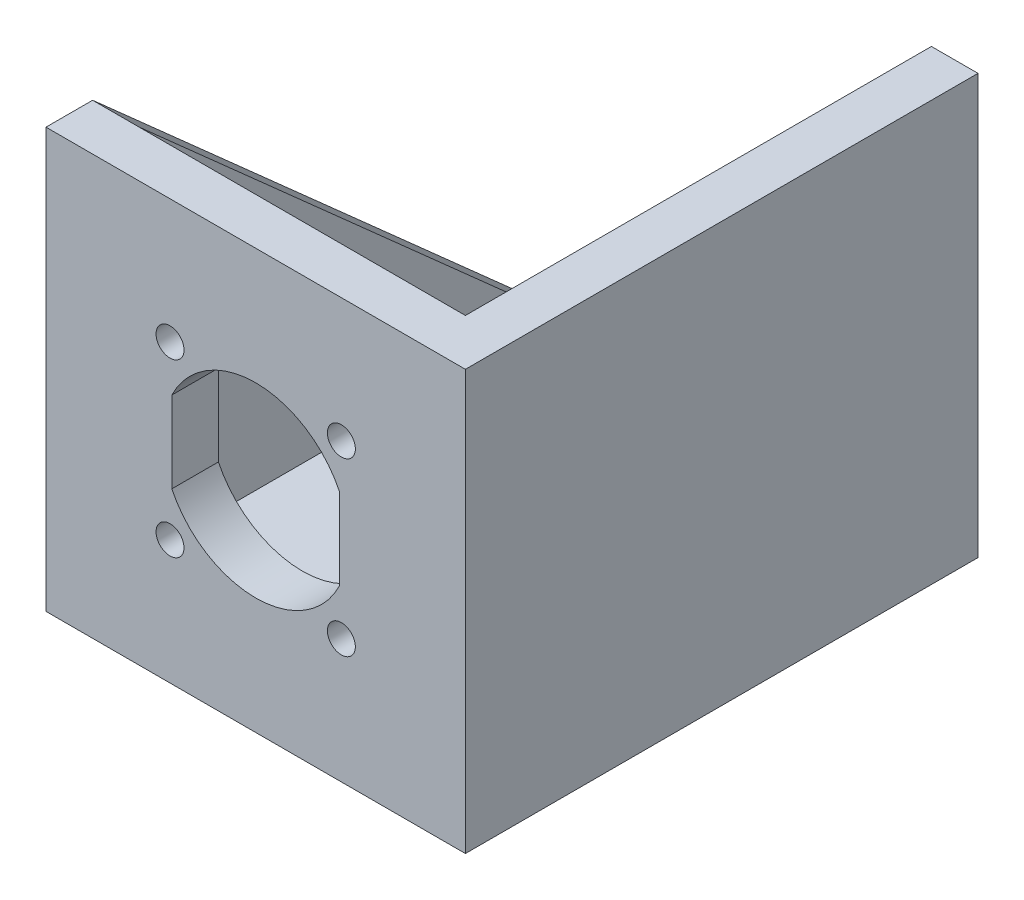
ISO-10303-21;
HEADER;
FILE_DESCRIPTION(('STEP AP214'),'2;1');
FILE_NAME('part.step','',(''),(''),'','','');
FILE_SCHEMA(('AUTOMOTIVE_DESIGN { 1 0 10303 214 1 1 1 1 }'));
ENDSEC;
DATA;
#1=APPLICATION_CONTEXT('core data for automotive mechanical design processes');
#2=APPLICATION_PROTOCOL_DEFINITION('international standard','automotive_design',2000,#1);
#3=PRODUCT_CONTEXT('',#1,'mechanical');
#4=PRODUCT('Part','Part','',(#3));
#5=PRODUCT_RELATED_PRODUCT_CATEGORY('part','',(#4));
#6=PRODUCT_DEFINITION_FORMATION('','',#4);
#7=PRODUCT_DEFINITION_CONTEXT('part definition',#1,'design');
#8=PRODUCT_DEFINITION('design','',#6,#7);
#9=PRODUCT_DEFINITION_SHAPE('','',#8);
#10=(LENGTH_UNIT() NAMED_UNIT(*) SI_UNIT(.MILLI.,.METRE.));
#11=(NAMED_UNIT(*) PLANE_ANGLE_UNIT() SI_UNIT($,.RADIAN.));
#12=(NAMED_UNIT(*) SI_UNIT($,.STERADIAN.) SOLID_ANGLE_UNIT());
#13=UNCERTAINTY_MEASURE_WITH_UNIT(LENGTH_MEASURE(1.E-05),#10,'distance_accuracy_value','');
#14=(GEOMETRIC_REPRESENTATION_CONTEXT(3) GLOBAL_UNCERTAINTY_ASSIGNED_CONTEXT((#13)) GLOBAL_UNIT_ASSIGNED_CONTEXT((#10,
#11,#12)) REPRESENTATION_CONTEXT('',''));
#15=CARTESIAN_POINT('',(0.,0.,0.));
#16=DIRECTION('',(0.,0.,1.));
#17=DIRECTION('',(1.,0.,0.));
#18=AXIS2_PLACEMENT_3D('',#15,#16,#17);
#19=CARTESIAN_POINT('',(0.,5.,95.));
#20=DIRECTION('',(0.,0.,1.));
#21=DIRECTION('',(1.,0.,0.));
#22=AXIS2_PLACEMENT_3D('',#19,#20,#21);
#23=PLANE('',#22);
#24=CARTESIAN_POINT('',(-8.30761184457486,31.6923881554251,95.));
#25=DIRECTION('',(0.,0.,1.));
#26=DIRECTION('',(1.,0.,0.));
#27=AXIS2_PLACEMENT_3D('',#24,#25,#26);
#28=CIRCLE('',#27,1.5);
#29=CARTESIAN_POINT('',(-6.80761184457486,31.6923881554251,95.));
#30=VERTEX_POINT('',#29);
#31=EDGE_CURVE('E201',#30,#30,#28,.F.);
#32=ORIENTED_EDGE('',*,*,#31,.F.);
#33=EDGE_LOOP('',(#32));
#34=FACE_BOUND('',#33,.T.);
#35=CARTESIAN_POINT('',(-8.30761184457486,13.3076118445749,95.));
#36=DIRECTION('',(0.,0.,1.));
#37=DIRECTION('',(1.,0.,0.));
#38=AXIS2_PLACEMENT_3D('',#35,#36,#37);
#39=CIRCLE('',#38,1.5);
#40=CARTESIAN_POINT('',(-6.80761184457486,13.3076118445749,95.));
#41=VERTEX_POINT('',#40);
#42=EDGE_CURVE('E211',#41,#41,#39,.F.);
#43=ORIENTED_EDGE('',*,*,#42,.F.);
#44=EDGE_LOOP('',(#43));
#45=FACE_BOUND('',#44,.T.);
#46=CARTESIAN_POINT('',(-26.6923881554251,13.3076118445749,95.));
#47=DIRECTION('',(0.,0.,1.));
#48=DIRECTION('',(1.,0.,0.));
#49=AXIS2_PLACEMENT_3D('',#46,#47,#48);
#50=CIRCLE('',#49,1.5);
#51=CARTESIAN_POINT('',(-25.1923881554251,13.3076118445749,95.));
#52=VERTEX_POINT('',#51);
#53=EDGE_CURVE('E217',#52,#52,#50,.F.);
#54=ORIENTED_EDGE('',*,*,#53,.F.);
#55=EDGE_LOOP('',(#54));
#56=FACE_BOUND('',#55,.T.);
#57=CARTESIAN_POINT('',(-26.6923881554251,31.6923881554251,95.));
#58=DIRECTION('',(0.,0.,1.));
#59=DIRECTION('',(1.,0.,0.));
#60=AXIS2_PLACEMENT_3D('',#57,#58,#59);
#61=CIRCLE('',#60,1.5);
#62=CARTESIAN_POINT('',(-25.1923881554251,31.6923881554251,95.));
#63=VERTEX_POINT('',#62);
#64=EDGE_CURVE('E223',#63,#63,#61,.F.);
#65=ORIENTED_EDGE('',*,*,#64,.F.);
#66=EDGE_LOOP('',(#65));
#67=FACE_BOUND('',#66,.T.);
#68=DIRECTION('',(0.,1.,0.));
#69=VECTOR('',#68,1.);
#70=CARTESIAN_POINT('',(-26.5,18.1411010564593,95.));
#71=LINE('',#70,#69);
#72=CARTESIAN_POINT('',(-26.5,18.1411010564593,95.));
#73=VERTEX_POINT('',#72);
#74=CARTESIAN_POINT('',(-26.5,26.8588989435407,95.));
#75=VERTEX_POINT('',#74);
#76=EDGE_CURVE('E228',#73,#75,#71,.T.);
#77=ORIENTED_EDGE('',*,*,#76,.F.);
#78=CARTESIAN_POINT('',(-17.5,22.5,95.));
#79=DIRECTION('',(0.,0.,1.));
#80=DIRECTION('',(1.,0.,0.));
#81=AXIS2_PLACEMENT_3D('',#78,#79,#80);
#82=CIRCLE('',#81,10.);
#83=CARTESIAN_POINT('',(-8.49999999999998,18.1411010564593,95.));
#84=VERTEX_POINT('',#83);
#85=EDGE_CURVE('E231',#84,#73,#82,.F.);
#86=ORIENTED_EDGE('',*,*,#85,.F.);
#87=DIRECTION('',(0.,-1.,0.));
#88=VECTOR('',#87,1.);
#89=CARTESIAN_POINT('',(-8.49999999999998,18.1411010564593,95.));
#90=LINE('',#89,#88);
#91=CARTESIAN_POINT('',(-8.49999999999998,26.8588989435407,95.));
#92=VERTEX_POINT('',#91);
#93=EDGE_CURVE('E248',#92,#84,#90,.T.);
#94=ORIENTED_EDGE('',*,*,#93,.F.);
#95=CARTESIAN_POINT('',(-17.5,22.5,95.));
#96=DIRECTION('',(0.,0.,1.));
#97=DIRECTION('',(1.,0.,0.));
#98=AXIS2_PLACEMENT_3D('',#95,#96,#97);
#99=CIRCLE('',#98,10.);
#100=EDGE_CURVE('E226',#75,#92,#99,.F.);
#101=ORIENTED_EDGE('',*,*,#100,.F.);
#102=EDGE_LOOP('',(#77,#86,#94,#101));
#103=FACE_BOUND('',#102,.T.);
#104=DIRECTION('',(0.,1.,0.));
#105=VECTOR('',#104,1.);
#106=CARTESIAN_POINT('',(-35.,5.,95.));
#107=LINE('',#106,#105);
#108=CARTESIAN_POINT('',(-35.,5.,95.));
#109=VERTEX_POINT('',#108);
#110=CARTESIAN_POINT('',(-35.,45.,95.));
#111=VERTEX_POINT('',#110);
#112=EDGE_CURVE('E262',#109,#111,#107,.T.);
#113=ORIENTED_EDGE('',*,*,#112,.T.);
#114=DIRECTION('',(-1.,0.,0.));
#115=VECTOR('',#114,1.);
#116=CARTESIAN_POINT('',(0.,45.,95.));
#117=LINE('',#116,#115);
#118=CARTESIAN_POINT('',(0.,45.,95.));
#119=VERTEX_POINT('',#118);
#120=EDGE_CURVE('E276',#119,#111,#117,.T.);
#121=ORIENTED_EDGE('',*,*,#120,.F.);
#122=DIRECTION('',(0.,1.,0.));
#123=VECTOR('',#122,1.);
#124=CARTESIAN_POINT('',(0.,5.,95.));
#125=LINE('',#124,#123);
#126=CARTESIAN_POINT('',(0.,5.,95.));
#127=VERTEX_POINT('',#126);
#128=EDGE_CURVE('E274',#127,#119,#125,.T.);
#129=ORIENTED_EDGE('',*,*,#128,.F.);
#130=DIRECTION('',(1.,0.,0.));
#131=VECTOR('',#130,1.);
#132=CARTESIAN_POINT('',(-40.,5.,95.));
#133=LINE('',#132,#131);
#134=EDGE_CURVE('E271',#109,#127,#133,.T.);
#135=ORIENTED_EDGE('',*,*,#134,.F.);
#136=EDGE_LOOP('',(#113,#121,#129,#135));
#137=FACE_BOUND('',#136,.T.);
#138=ADVANCED_FACE('F29',(#34,#45,#56,#67,#103,#137),#23,.F.);
#139=CARTESIAN_POINT('',(0.,0.,5.));
#140=DIRECTION('',(1.,0.,0.));
#141=DIRECTION('',(0.,0.,-1.));
#142=AXIS2_PLACEMENT_3D('',#139,#140,#141);
#143=PLANE('',#142);
#144=DIRECTION('',(0.,0.,-1.));
#145=VECTOR('',#144,1.);
#146=CARTESIAN_POINT('',(0.,45.,5.));
#147=LINE('',#146,#145);
#148=CARTESIAN_POINT('',(0.,45.,45.));
#149=VERTEX_POINT('',#148);
#150=EDGE_CURVE('E154',#119,#149,#147,.T.);
#151=ORIENTED_EDGE('',*,*,#150,.T.);
#152=DIRECTION('',(0.,-1.,0.));
#153=VECTOR('',#152,1.);
#154=CARTESIAN_POINT('',(0.,0.,45.));
#155=LINE('',#154,#153);
#156=CARTESIAN_POINT('',(0.,5.,45.));
#157=VERTEX_POINT('',#156);
#158=EDGE_CURVE('E284',#149,#157,#155,.T.);
#159=ORIENTED_EDGE('',*,*,#158,.T.);
#160=DIRECTION('',(0.,0.,-1.));
#161=VECTOR('',#160,1.);
#162=CARTESIAN_POINT('',(0.,5.,0.));
#163=LINE('',#162,#161);
#164=EDGE_CURVE('E162',#127,#157,#163,.T.);
#165=ORIENTED_EDGE('',*,*,#164,.F.);
#166=ORIENTED_EDGE('',*,*,#128,.T.);
#167=EDGE_LOOP('',(#151,#159,#165,#166));
#168=FACE_BOUND('',#167,.T.);
#169=ADVANCED_FACE('F31',(#168),#143,.F.);
#170=CARTESIAN_POINT('',(-40.,5.,0.));
#171=DIRECTION('',(0.,-1.,0.));
#172=DIRECTION('',(0.,0.,-1.));
#173=AXIS2_PLACEMENT_3D('',#170,#171,#172);
#174=PLANE('',#173);
#175=CARTESIAN_POINT('',(-19.8901308005901,5.,72.4968960498842));
#176=DIRECTION('',(0.,1.,0.));
#177=DIRECTION('',(0.,0.,1.));
#178=AXIS2_PLACEMENT_3D('',#175,#176,#177);
#179=CIRCLE('',#178,2.);
#180=CARTESIAN_POINT('',(-19.8901308005901,5.,74.4968960498842));
#181=VERTEX_POINT('',#180);
#182=EDGE_CURVE('E305',#181,#181,#179,.T.);
#183=ORIENTED_EDGE('',*,*,#182,.F.);
#184=EDGE_LOOP('',(#183));
#185=FACE_BOUND('',#184,.T.);
#186=ORIENTED_EDGE('',*,*,#164,.T.);
#187=DIRECTION('',(-1.,0.,0.));
#188=VECTOR('',#187,1.);
#189=CARTESIAN_POINT('',(-40.,5.,45.));
#190=LINE('',#189,#188);
#191=CARTESIAN_POINT('',(-33.5,5.,45.));
#192=VERTEX_POINT('',#191);
#193=EDGE_CURVE('E288',#157,#192,#190,.T.);
#194=ORIENTED_EDGE('',*,*,#193,.T.);
#195=CARTESIAN_POINT('',(-35.,5.,45.));
#196=DIRECTION('',(0.,1.,0.));
#197=DIRECTION('',(0.,0.,1.));
#198=AXIS2_PLACEMENT_3D('',#195,#196,#197);
#199=CIRCLE('',#198,1.5);
#200=CARTESIAN_POINT('',(-36.5,5.,45.));
#201=VERTEX_POINT('',#200);
#202=EDGE_CURVE('E198',#201,#192,#199,.T.);
#203=ORIENTED_EDGE('',*,*,#202,.F.);
#204=CARTESIAN_POINT('',(-40.,5.,45.));
#205=VERTEX_POINT('',#204);
#206=EDGE_CURVE('E297',#201,#205,#190,.T.);
#207=ORIENTED_EDGE('',*,*,#206,.T.);
#208=DIRECTION('',(0.,0.,-1.));
#209=VECTOR('',#208,1.);
#210=CARTESIAN_POINT('',(-40.,5.,0.));
#211=LINE('',#210,#209);
#212=CARTESIAN_POINT('',(-40.,5.,50.));
#213=VERTEX_POINT('',#212);
#214=EDGE_CURVE('E139',#213,#205,#211,.T.);
#215=ORIENTED_EDGE('',*,*,#214,.F.);
#216=DIRECTION('',(-1.,0.,0.));
#217=VECTOR('',#216,1.);
#218=CARTESIAN_POINT('',(-35.,5.,50.));
#219=LINE('',#218,#217);
#220=CARTESIAN_POINT('',(-35.,5.,50.));
#221=VERTEX_POINT('',#220);
#222=EDGE_CURVE('E269',#221,#213,#219,.T.);
#223=ORIENTED_EDGE('',*,*,#222,.F.);
#224=DIRECTION('',(0.,0.,1.));
#225=VECTOR('',#224,1.);
#226=CARTESIAN_POINT('',(-35.,5.,50.));
#227=LINE('',#226,#225);
#228=EDGE_CURVE('E259',#221,#109,#227,.T.);
#229=ORIENTED_EDGE('',*,*,#228,.T.);
#230=ORIENTED_EDGE('',*,*,#134,.T.);
#231=EDGE_LOOP('',(#186,#194,#203,#207,#215,#223,#229,#230));
#232=FACE_BOUND('',#231,.T.);
#233=ADVANCED_FACE('F287',(#185,#232),#174,.F.);
#234=CARTESIAN_POINT('',(0.,0.,5.));
#235=DIRECTION('',(0.,1.,0.));
#236=DIRECTION('',(0.,0.,1.));
#237=AXIS2_PLACEMENT_3D('',#234,#235,#236);
#238=PLANE('',#237);
#239=CARTESIAN_POINT('',(-19.8901308005901,0.,72.4968960498842));
#240=DIRECTION('',(0.,1.,0.));
#241=DIRECTION('',(0.,0.,1.));
#242=AXIS2_PLACEMENT_3D('',#239,#240,#241);
#243=CIRCLE('',#242,2.);
#244=CARTESIAN_POINT('',(-19.8901308005901,0.,74.4968960498842));
#245=VERTEX_POINT('',#244);
#246=EDGE_CURVE('E149',#245,#245,#243,.F.);
#247=ORIENTED_EDGE('',*,*,#246,.F.);
#248=EDGE_LOOP('',(#247));
#249=FACE_BOUND('',#248,.T.);
#250=DIRECTION('',(-1.,0.,0.));
#251=VECTOR('',#250,1.);
#252=CARTESIAN_POINT('',(45.,0.,45.));
#253=LINE('',#252,#251);
#254=CARTESIAN_POINT('',(5.,0.,45.));
#255=VERTEX_POINT('',#254);
#256=CARTESIAN_POINT('',(-33.5,0.,45.));
#257=VERTEX_POINT('',#256);
#258=EDGE_CURVE('E49',#255,#257,#253,.T.);
#259=ORIENTED_EDGE('',*,*,#258,.F.);
#260=DIRECTION('',(0.,0.,-1.));
#261=VECTOR('',#260,1.);
#262=CARTESIAN_POINT('',(5.,0.,100.));
#263=LINE('',#262,#261);
#264=CARTESIAN_POINT('',(5.,0.,100.));
#265=VERTEX_POINT('',#264);
#266=EDGE_CURVE('E133',#265,#255,#263,.T.);
#267=ORIENTED_EDGE('',*,*,#266,.F.);
#268=DIRECTION('',(1.,0.,0.));
#269=VECTOR('',#268,1.);
#270=CARTESIAN_POINT('',(0.,0.,100.));
#271=LINE('',#270,#269);
#272=CARTESIAN_POINT('',(-40.,0.,100.));
#273=VERTEX_POINT('',#272);
#274=EDGE_CURVE('E145',#273,#265,#271,.T.);
#275=ORIENTED_EDGE('',*,*,#274,.F.);
#276=DIRECTION('',(0.,0.,1.));
#277=VECTOR('',#276,1.);
#278=CARTESIAN_POINT('',(-40.,0.,0.));
#279=LINE('',#278,#277);
#280=CARTESIAN_POINT('',(-40.,0.,45.));
#281=VERTEX_POINT('',#280);
#282=EDGE_CURVE('E165',#281,#273,#279,.T.);
#283=ORIENTED_EDGE('',*,*,#282,.F.);
#284=CARTESIAN_POINT('',(-36.5,0.,45.));
#285=VERTEX_POINT('',#284);
#286=EDGE_CURVE('E148',#285,#281,#253,.T.);
#287=ORIENTED_EDGE('',*,*,#286,.F.);
#288=CARTESIAN_POINT('',(-35.,0.,45.));
#289=DIRECTION('',(0.,1.,0.));
#290=DIRECTION('',(0.,0.,1.));
#291=AXIS2_PLACEMENT_3D('',#288,#289,#290);
#292=CIRCLE('',#291,1.5);
#293=EDGE_CURVE('E189',#257,#285,#292,.F.);
#294=ORIENTED_EDGE('',*,*,#293,.F.);
#295=EDGE_LOOP('',(#259,#267,#275,#283,#287,#294));
#296=FACE_BOUND('',#295,.T.);
#297=ADVANCED_FACE('F143',(#249,#296),#238,.F.);
#298=CARTESIAN_POINT('',(0.,45.,5.));
#299=DIRECTION('',(0.,-1.,0.));
#300=DIRECTION('',(0.,0.,-1.));
#301=AXIS2_PLACEMENT_3D('',#298,#299,#300);
#302=PLANE('',#301);
#303=DIRECTION('',(0.,0.,-1.));
#304=VECTOR('',#303,1.);
#305=CARTESIAN_POINT('',(5.,45.,5.));
#306=LINE('',#305,#304);
#307=CARTESIAN_POINT('',(5.,45.,100.));
#308=VERTEX_POINT('',#307);
#309=CARTESIAN_POINT('',(5.,45.,45.));
#310=VERTEX_POINT('',#309);
#311=EDGE_CURVE('E135',#308,#310,#306,.T.);
#312=ORIENTED_EDGE('',*,*,#311,.T.);
#313=DIRECTION('',(-1.,0.,0.));
#314=VECTOR('',#313,1.);
#315=CARTESIAN_POINT('',(0.,45.,45.));
#316=LINE('',#315,#314);
#317=EDGE_CURVE('E178',#310,#149,#316,.T.);
#318=ORIENTED_EDGE('',*,*,#317,.T.);
#319=ORIENTED_EDGE('',*,*,#150,.F.);
#320=ORIENTED_EDGE('',*,*,#120,.T.);
#321=DIRECTION('',(-1.,0.,0.));
#322=VECTOR('',#321,1.);
#323=CARTESIAN_POINT('',(-35.,45.,95.));
#324=LINE('',#323,#322);
#325=CARTESIAN_POINT('',(-40.,45.,95.));
#326=VERTEX_POINT('',#325);
#327=EDGE_CURVE('E268',#111,#326,#324,.T.);
#328=ORIENTED_EDGE('',*,*,#327,.T.);
#329=DIRECTION('',(0.,0.,1.));
#330=VECTOR('',#329,1.);
#331=CARTESIAN_POINT('',(-40.,45.,95.));
#332=LINE('',#331,#330);
#333=CARTESIAN_POINT('',(-40.,45.,100.));
#334=VERTEX_POINT('',#333);
#335=EDGE_CURVE('E166',#326,#334,#332,.T.);
#336=ORIENTED_EDGE('',*,*,#335,.T.);
#337=DIRECTION('',(-1.,0.,0.));
#338=VECTOR('',#337,1.);
#339=CARTESIAN_POINT('',(5.,45.,100.));
#340=LINE('',#339,#338);
#341=EDGE_CURVE('E155',#308,#334,#340,.T.);
#342=ORIENTED_EDGE('',*,*,#341,.F.);
#343=EDGE_LOOP('',(#312,#318,#319,#320,#328,#336,#342));
#344=FACE_BOUND('',#343,.T.);
#345=ADVANCED_FACE('F176',(#344),#302,.F.);
#346=CARTESIAN_POINT('',(0.,5.,100.));
#347=DIRECTION('',(0.,0.,-1.));
#348=DIRECTION('',(-1.,0.,0.));
#349=AXIS2_PLACEMENT_3D('',#346,#347,#348);
#350=PLANE('',#349);
#351=CARTESIAN_POINT('',(-8.30761184457486,31.6923881554251,100.));
#352=DIRECTION('',(0.,0.,1.));
#353=DIRECTION('',(-1.,0.,0.));
#354=AXIS2_PLACEMENT_3D('',#351,#352,#353);
#355=CIRCLE('',#354,1.5);
#356=CARTESIAN_POINT('',(-9.80761184457487,31.6923881554251,100.));
#357=VERTEX_POINT('',#356);
#358=EDGE_CURVE('E197',#357,#357,#355,.T.);
#359=ORIENTED_EDGE('',*,*,#358,.F.);
#360=EDGE_LOOP('',(#359));
#361=FACE_BOUND('',#360,.T.);
#362=CARTESIAN_POINT('',(-8.30761184457486,13.3076118445749,100.));
#363=DIRECTION('',(0.,0.,1.));
#364=DIRECTION('',(1.,0.,0.));
#365=AXIS2_PLACEMENT_3D('',#362,#363,#364);
#366=CIRCLE('',#365,1.5);
#367=CARTESIAN_POINT('',(-6.80761184457486,13.3076118445749,100.));
#368=VERTEX_POINT('',#367);
#369=EDGE_CURVE('E208',#368,#368,#366,.T.);
#370=ORIENTED_EDGE('',*,*,#369,.F.);
#371=EDGE_LOOP('',(#370));
#372=FACE_BOUND('',#371,.T.);
#373=CARTESIAN_POINT('',(-26.6923881554251,13.3076118445749,100.));
#374=DIRECTION('',(0.,0.,1.));
#375=DIRECTION('',(-1.,0.,0.));
#376=AXIS2_PLACEMENT_3D('',#373,#374,#375);
#377=CIRCLE('',#376,1.5);
#378=CARTESIAN_POINT('',(-28.1923881554251,13.3076118445749,100.));
#379=VERTEX_POINT('',#378);
#380=EDGE_CURVE('E214',#379,#379,#377,.T.);
#381=ORIENTED_EDGE('',*,*,#380,.F.);
#382=EDGE_LOOP('',(#381));
#383=FACE_BOUND('',#382,.T.);
#384=CARTESIAN_POINT('',(-26.6923881554251,31.6923881554251,100.));
#385=DIRECTION('',(0.,0.,1.));
#386=DIRECTION('',(1.,0.,0.));
#387=AXIS2_PLACEMENT_3D('',#384,#385,#386);
#388=CIRCLE('',#387,1.5);
#389=CARTESIAN_POINT('',(-25.1923881554251,31.6923881554251,100.));
#390=VERTEX_POINT('',#389);
#391=EDGE_CURVE('E220',#390,#390,#388,.T.);
#392=ORIENTED_EDGE('',*,*,#391,.F.);
#393=EDGE_LOOP('',(#392));
#394=FACE_BOUND('',#393,.T.);
#395=DIRECTION('',(0.,1.,0.));
#396=VECTOR('',#395,1.);
#397=CARTESIAN_POINT('',(-8.49999999999998,18.1411010564593,100.));
#398=LINE('',#397,#396);
#399=CARTESIAN_POINT('',(-8.49999999999998,18.1411010564593,100.));
#400=VERTEX_POINT('',#399);
#401=CARTESIAN_POINT('',(-8.49999999999999,26.8588989435407,100.));
#402=VERTEX_POINT('',#401);
#403=EDGE_CURVE('E236',#400,#402,#398,.T.);
#404=ORIENTED_EDGE('',*,*,#403,.F.);
#405=CARTESIAN_POINT('',(-17.5,22.5,100.));
#406=DIRECTION('',(0.,0.,1.));
#407=DIRECTION('',(1.,0.,0.));
#408=AXIS2_PLACEMENT_3D('',#405,#406,#407);
#409=CIRCLE('',#408,10.);
#410=CARTESIAN_POINT('',(-26.5,18.1411010564593,100.));
#411=VERTEX_POINT('',#410);
#412=EDGE_CURVE('E234',#411,#400,#409,.T.);
#413=ORIENTED_EDGE('',*,*,#412,.F.);
#414=DIRECTION('',(0.,-1.,0.));
#415=VECTOR('',#414,1.);
#416=CARTESIAN_POINT('',(-26.5,18.1411010564593,100.));
#417=LINE('',#416,#415);
#418=CARTESIAN_POINT('',(-26.5,26.8588989435407,100.));
#419=VERTEX_POINT('',#418);
#420=EDGE_CURVE('E242',#419,#411,#417,.T.);
#421=ORIENTED_EDGE('',*,*,#420,.F.);
#422=CARTESIAN_POINT('',(-17.5,22.5,100.));
#423=DIRECTION('',(0.,0.,1.));
#424=DIRECTION('',(1.,0.,0.));
#425=AXIS2_PLACEMENT_3D('',#422,#423,#424);
#426=CIRCLE('',#425,10.);
#427=EDGE_CURVE('E239',#402,#419,#426,.T.);
#428=ORIENTED_EDGE('',*,*,#427,.F.);
#429=EDGE_LOOP('',(#404,#413,#421,#428));
#430=FACE_BOUND('',#429,.T.);
#431=ORIENTED_EDGE('',*,*,#274,.T.);
#432=DIRECTION('',(0.,1.,0.));
#433=VECTOR('',#432,1.);
#434=CARTESIAN_POINT('',(5.,45.,100.));
#435=LINE('',#434,#433);
#436=EDGE_CURVE('E130',#265,#308,#435,.T.);
#437=ORIENTED_EDGE('',*,*,#436,.T.);
#438=ORIENTED_EDGE('',*,*,#341,.T.);
#439=DIRECTION('',(0.,1.,0.));
#440=VECTOR('',#439,1.);
#441=CARTESIAN_POINT('',(-40.,0.,100.));
#442=LINE('',#441,#440);
#443=EDGE_CURVE('E153',#273,#334,#442,.T.);
#444=ORIENTED_EDGE('',*,*,#443,.F.);
#445=EDGE_LOOP('',(#431,#437,#438,#444));
#446=FACE_BOUND('',#445,.T.);
#447=ADVANCED_FACE('F151',(#361,#372,#383,#394,#430,#446),#350,.F.);
#448=CARTESIAN_POINT('',(5.,5.,5.));
#449=DIRECTION('',(1.,0.,0.));
#450=DIRECTION('',(0.,0.,-1.));
#451=AXIS2_PLACEMENT_3D('',#448,#449,#450);
#452=PLANE('',#451);
#453=ORIENTED_EDGE('',*,*,#311,.F.);
#454=ORIENTED_EDGE('',*,*,#436,.F.);
#455=ORIENTED_EDGE('',*,*,#266,.T.);
#456=DIRECTION('',(0.,-1.,0.));
#457=VECTOR('',#456,1.);
#458=CARTESIAN_POINT('',(5.,5.,45.));
#459=LINE('',#458,#457);
#460=EDGE_CURVE('E44',#310,#255,#459,.T.);
#461=ORIENTED_EDGE('',*,*,#460,.F.);
#462=EDGE_LOOP('',(#453,#454,#455,#461));
#463=FACE_BOUND('',#462,.T.);
#464=ADVANCED_FACE('F132',(#463),#452,.T.);
#465=CARTESIAN_POINT('',(-40.,0.,0.));
#466=DIRECTION('',(1.,0.,0.));
#467=DIRECTION('',(0.,0.,-1.));
#468=AXIS2_PLACEMENT_3D('',#465,#466,#467);
#469=PLANE('',#468);
#470=ORIENTED_EDGE('',*,*,#214,.T.);
#471=DIRECTION('',(0.,-1.,0.));
#472=VECTOR('',#471,1.);
#473=CARTESIAN_POINT('',(-40.,0.,45.));
#474=LINE('',#473,#472);
#475=EDGE_CURVE('E186',#205,#281,#474,.T.);
#476=ORIENTED_EDGE('',*,*,#475,.T.);
#477=ORIENTED_EDGE('',*,*,#282,.T.);
#478=ORIENTED_EDGE('',*,*,#443,.T.);
#479=ORIENTED_EDGE('',*,*,#335,.F.);
#480=DIRECTION('',(0.,-0.66436383882992,-0.74740931868366));
#481=VECTOR('',#480,1.);
#482=CARTESIAN_POINT('',(-40.,45.,95.));
#483=LINE('',#482,#481);
#484=EDGE_CURVE('E257',#326,#213,#483,.T.);
#485=ORIENTED_EDGE('',*,*,#484,.T.);
#486=EDGE_LOOP('',(#470,#476,#477,#478,#479,#485));
#487=FACE_BOUND('',#486,.T.);
#488=ADVANCED_FACE('F183',(#487),#469,.F.);
#489=CARTESIAN_POINT('',(-35.,45.,95.));
#490=DIRECTION('',(0.,0.74740931868366,-0.66436383882992));
#491=DIRECTION('',(0.,0.66436383882992,0.74740931868366));
#492=AXIS2_PLACEMENT_3D('',#489,#490,#491);
#493=PLANE('',#492);
#494=ORIENTED_EDGE('',*,*,#484,.F.);
#495=ORIENTED_EDGE('',*,*,#327,.F.);
#496=DIRECTION('',(0.,-0.66436383882992,-0.74740931868366));
#497=VECTOR('',#496,1.);
#498=CARTESIAN_POINT('',(-35.,45.,95.));
#499=LINE('',#498,#497);
#500=EDGE_CURVE('E265',#111,#221,#499,.T.);
#501=ORIENTED_EDGE('',*,*,#500,.T.);
#502=ORIENTED_EDGE('',*,*,#222,.T.);
#503=EDGE_LOOP('',(#494,#495,#501,#502));
#504=FACE_BOUND('',#503,.T.);
#505=ADVANCED_FACE('F295',(#504),#493,.T.);
#506=CARTESIAN_POINT('',(-35.,5.,95.));
#507=DIRECTION('',(-1.,0.,0.));
#508=DIRECTION('',(0.,0.,1.));
#509=AXIS2_PLACEMENT_3D('',#506,#507,#508);
#510=PLANE('',#509);
#511=ORIENTED_EDGE('',*,*,#228,.F.);
#512=ORIENTED_EDGE('',*,*,#500,.F.);
#513=ORIENTED_EDGE('',*,*,#112,.F.);
#514=EDGE_LOOP('',(#511,#512,#513));
#515=FACE_BOUND('',#514,.T.);
#516=ADVANCED_FACE('F293',(#515),#510,.F.);
#517=CARTESIAN_POINT('',(-17.5,22.5,-0.00105000000000244));
#518=DIRECTION('',(0.,0.,1.));
#519=DIRECTION('',(1.,0.,0.));
#520=AXIS2_PLACEMENT_3D('',#517,#518,#519);
#521=CYLINDRICAL_SURFACE('',#520,10.);
#522=ORIENTED_EDGE('',*,*,#85,.T.);
#523=DIRECTION('',(0.,0.,1.));
#524=VECTOR('',#523,1.);
#525=CARTESIAN_POINT('',(-26.5,18.1411010564593,-0.00105000000000244));
#526=LINE('',#525,#524);
#527=EDGE_CURVE('E246',#73,#411,#526,.T.);
#528=ORIENTED_EDGE('',*,*,#527,.T.);
#529=ORIENTED_EDGE('',*,*,#412,.T.);
#530=DIRECTION('',(0.,0.,1.));
#531=VECTOR('',#530,1.);
#532=CARTESIAN_POINT('',(-8.49999999999998,18.1411010564593,-0.00105000000000244));
#533=LINE('',#532,#531);
#534=EDGE_CURVE('E245',#84,#400,#533,.T.);
#535=ORIENTED_EDGE('',*,*,#534,.F.);
#536=EDGE_LOOP('',(#522,#528,#529,#535));
#537=FACE_BOUND('',#536,.T.);
#538=ADVANCED_FACE('F410',(#537),#521,.F.);
#539=CARTESIAN_POINT('',(-26.5,18.1411010564593,-0.00105000000000244));
#540=DIRECTION('',(-1.,0.,0.));
#541=DIRECTION('',(0.,0.,1.));
#542=AXIS2_PLACEMENT_3D('',#539,#540,#541);
#543=PLANE('',#542);
#544=ORIENTED_EDGE('',*,*,#76,.T.);
#545=DIRECTION('',(0.,0.,1.));
#546=VECTOR('',#545,1.);
#547=CARTESIAN_POINT('',(-26.5,26.8588989435407,-0.00105000000000244));
#548=LINE('',#547,#546);
#549=EDGE_CURVE('E249',#75,#419,#548,.T.);
#550=ORIENTED_EDGE('',*,*,#549,.T.);
#551=ORIENTED_EDGE('',*,*,#420,.T.);
#552=ORIENTED_EDGE('',*,*,#527,.F.);
#553=EDGE_LOOP('',(#544,#550,#551,#552));
#554=FACE_BOUND('',#553,.T.);
#555=ADVANCED_FACE('F403',(#554),#543,.F.);
#556=CARTESIAN_POINT('',(-17.5,22.5,-0.00105000000000244));
#557=DIRECTION('',(0.,0.,1.));
#558=DIRECTION('',(1.,0.,0.));
#559=AXIS2_PLACEMENT_3D('',#556,#557,#558);
#560=CYLINDRICAL_SURFACE('',#559,10.);
#561=ORIENTED_EDGE('',*,*,#100,.T.);
#562=DIRECTION('',(0.,0.,1.));
#563=VECTOR('',#562,1.);
#564=CARTESIAN_POINT('',(-8.49999999999999,26.8588989435407,-0.00105000000000244));
#565=LINE('',#564,#563);
#566=EDGE_CURVE('E251',#92,#402,#565,.T.);
#567=ORIENTED_EDGE('',*,*,#566,.T.);
#568=ORIENTED_EDGE('',*,*,#427,.T.);
#569=ORIENTED_EDGE('',*,*,#549,.F.);
#570=EDGE_LOOP('',(#561,#567,#568,#569));
#571=FACE_BOUND('',#570,.T.);
#572=ADVANCED_FACE('F395',(#571),#560,.F.);
#573=CARTESIAN_POINT('',(-8.49999999999998,18.1411010564593,-0.00105000000000244));
#574=DIRECTION('',(1.,0.,0.));
#575=DIRECTION('',(0.,0.,-1.));
#576=AXIS2_PLACEMENT_3D('',#573,#574,#575);
#577=PLANE('',#576);
#578=ORIENTED_EDGE('',*,*,#93,.T.);
#579=ORIENTED_EDGE('',*,*,#534,.T.);
#580=ORIENTED_EDGE('',*,*,#403,.T.);
#581=ORIENTED_EDGE('',*,*,#566,.F.);
#582=EDGE_LOOP('',(#578,#579,#580,#581));
#583=FACE_BOUND('',#582,.T.);
#584=ADVANCED_FACE('F387',(#583),#577,.F.);
#585=CARTESIAN_POINT('',(-26.6923881554251,31.6923881554251,-0.00105000000000244));
#586=DIRECTION('',(0.,0.,1.));
#587=DIRECTION('',(1.,0.,0.));
#588=AXIS2_PLACEMENT_3D('',#585,#586,#587);
#589=CYLINDRICAL_SURFACE('',#588,1.5);
#590=ORIENTED_EDGE('',*,*,#391,.T.);
#591=EDGE_LOOP('',(#590));
#592=FACE_BOUND('',#591,.T.);
#593=ORIENTED_EDGE('',*,*,#64,.T.);
#594=EDGE_LOOP('',(#593));
#595=FACE_BOUND('',#594,.T.);
#596=ADVANCED_FACE('F379',(#592,#595),#589,.F.);
#597=CARTESIAN_POINT('',(-26.6923881554251,13.3076118445749,-0.00105000000000244));
#598=DIRECTION('',(0.,0.,1.));
#599=DIRECTION('',(1.,0.,0.));
#600=AXIS2_PLACEMENT_3D('',#597,#598,#599);
#601=CYLINDRICAL_SURFACE('',#600,1.5);
#602=ORIENTED_EDGE('',*,*,#380,.T.);
#603=EDGE_LOOP('',(#602));
#604=FACE_BOUND('',#603,.T.);
#605=ORIENTED_EDGE('',*,*,#53,.T.);
#606=EDGE_LOOP('',(#605));
#607=FACE_BOUND('',#606,.T.);
#608=ADVANCED_FACE('F371',(#604,#607),#601,.F.);
#609=CARTESIAN_POINT('',(-8.30761184457486,13.3076118445749,-0.00105000000000244));
#610=DIRECTION('',(0.,0.,1.));
#611=DIRECTION('',(1.,0.,0.));
#612=AXIS2_PLACEMENT_3D('',#609,#610,#611);
#613=CYLINDRICAL_SURFACE('',#612,1.5);
#614=ORIENTED_EDGE('',*,*,#369,.T.);
#615=EDGE_LOOP('',(#614));
#616=FACE_BOUND('',#615,.T.);
#617=ORIENTED_EDGE('',*,*,#42,.T.);
#618=EDGE_LOOP('',(#617));
#619=FACE_BOUND('',#618,.T.);
#620=ADVANCED_FACE('F362',(#616,#619),#613,.F.);
#621=CARTESIAN_POINT('',(-8.30761184457486,31.6923881554251,-0.00105000000000244));
#622=DIRECTION('',(0.,0.,1.));
#623=DIRECTION('',(1.,0.,0.));
#624=AXIS2_PLACEMENT_3D('',#621,#622,#623);
#625=CYLINDRICAL_SURFACE('',#624,1.5);
#626=ORIENTED_EDGE('',*,*,#358,.T.);
#627=EDGE_LOOP('',(#626));
#628=FACE_BOUND('',#627,.T.);
#629=ORIENTED_EDGE('',*,*,#31,.T.);
#630=EDGE_LOOP('',(#629));
#631=FACE_BOUND('',#630,.T.);
#632=ADVANCED_FACE('F358',(#628,#631),#625,.F.);
#633=CARTESIAN_POINT('',(-35.,-0.00100000000000013,45.));
#634=DIRECTION('',(0.,1.,0.));
#635=DIRECTION('',(0.,0.,1.));
#636=AXIS2_PLACEMENT_3D('',#633,#634,#635);
#637=CYLINDRICAL_SURFACE('',#636,1.5);
#638=ORIENTED_EDGE('',*,*,#202,.T.);
#639=DIRECTION('',(0.,1.,0.));
#640=VECTOR('',#639,1.);
#641=CARTESIAN_POINT('',(-33.5,-0.00100000000000013,45.));
#642=LINE('',#641,#640);
#643=EDGE_CURVE('E11',#192,#257,#642,.F.);
#644=ORIENTED_EDGE('',*,*,#643,.T.);
#645=ORIENTED_EDGE('',*,*,#293,.T.);
#646=DIRECTION('',(0.,1.,0.));
#647=VECTOR('',#646,1.);
#648=CARTESIAN_POINT('',(-36.5,-0.00100000000000013,45.));
#649=LINE('',#648,#647);
#650=EDGE_CURVE('E37',#285,#201,#649,.T.);
#651=ORIENTED_EDGE('',*,*,#650,.T.);
#652=EDGE_LOOP('',(#638,#644,#645,#651));
#653=FACE_BOUND('',#652,.T.);
#654=ADVANCED_FACE('F195',(#653),#637,.F.);
#655=CARTESIAN_POINT('',(45.,49.0146017927913,45.));
#656=DIRECTION('',(0.,0.,1.));
#657=DIRECTION('',(1.,0.,0.));
#658=AXIS2_PLACEMENT_3D('',#655,#656,#657);
#659=PLANE('',#658);
#660=ORIENTED_EDGE('',*,*,#206,.F.);
#661=ORIENTED_EDGE('',*,*,#650,.F.);
#662=ORIENTED_EDGE('',*,*,#286,.T.);
#663=ORIENTED_EDGE('',*,*,#475,.F.);
#664=EDGE_LOOP('',(#660,#661,#662,#663));
#665=FACE_BOUND('',#664,.T.);
#666=ADVANCED_FACE('F448',(#665),#659,.F.);
#667=ORIENTED_EDGE('',*,*,#460,.T.);
#668=ORIENTED_EDGE('',*,*,#258,.T.);
#669=ORIENTED_EDGE('',*,*,#643,.F.);
#670=ORIENTED_EDGE('',*,*,#193,.F.);
#671=ORIENTED_EDGE('',*,*,#158,.F.);
#672=ORIENTED_EDGE('',*,*,#317,.F.);
#673=EDGE_LOOP('',(#667,#668,#669,#670,#671,#672));
#674=FACE_BOUND('',#673,.T.);
#675=ADVANCED_FACE('F451',(#674),#659,.F.);
#676=CARTESIAN_POINT('',(-19.8901308005901,-0.001000000000001,72.4968960498842));
#677=DIRECTION('',(0.,1.,0.));
#678=DIRECTION('',(0.,0.,1.));
#679=AXIS2_PLACEMENT_3D('',#676,#677,#678);
#680=CYLINDRICAL_SURFACE('',#679,2.);
#681=ORIENTED_EDGE('',*,*,#182,.T.);
#682=EDGE_LOOP('',(#681));
#683=FACE_BOUND('',#682,.T.);
#684=ORIENTED_EDGE('',*,*,#246,.T.);
#685=EDGE_LOOP('',(#684));
#686=FACE_BOUND('',#685,.T.);
#687=ADVANCED_FACE('F309',(#683,#686),#680,.F.);
#688=CLOSED_SHELL('',(#138,#169,#233,#297,#345,#447,#464,#488,#505,#516,#538,#555,#572,#584,
#596,#608,#620,#632,#654,#666,#675,#687));
#689=MANIFOLD_SOLID_BREP('B2',#688);
#690=ADVANCED_BREP_SHAPE_REPRESENTATION('',(#18,#689),#14);
#691=SHAPE_DEFINITION_REPRESENTATION(#9,#690);
ENDSEC;
END-ISO-10303-21;
